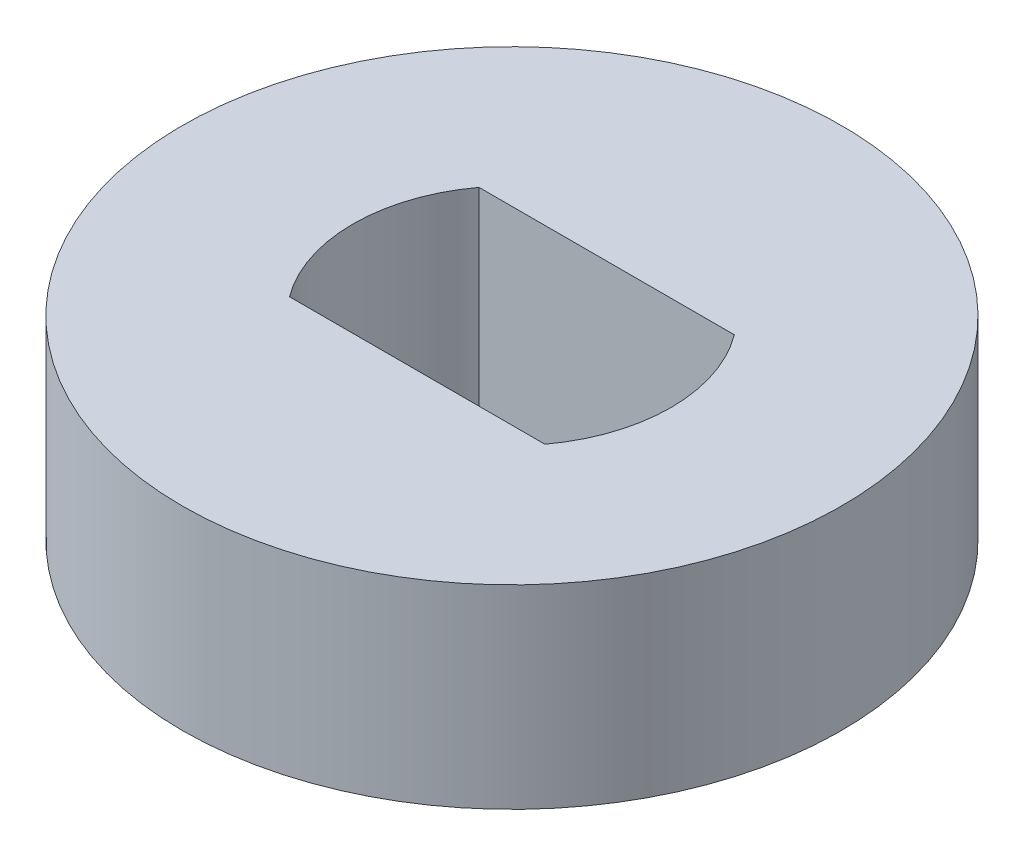
ISO-10303-21;
HEADER;
FILE_DESCRIPTION(('STEP AP214'),'2;1');
FILE_NAME('part.step','',(''),(''),'','','');
FILE_SCHEMA(('AUTOMOTIVE_DESIGN { 1 0 10303 214 1 1 1 1 }'));
ENDSEC;
DATA;
#1=APPLICATION_CONTEXT('core data for automotive mechanical design processes');
#2=APPLICATION_PROTOCOL_DEFINITION('international standard','automotive_design',2000,#1);
#3=PRODUCT_CONTEXT('',#1,'mechanical');
#4=PRODUCT('Part','Part','',(#3));
#5=PRODUCT_RELATED_PRODUCT_CATEGORY('part','',(#4));
#6=PRODUCT_DEFINITION_FORMATION('','',#4);
#7=PRODUCT_DEFINITION_CONTEXT('part definition',#1,'design');
#8=PRODUCT_DEFINITION('design','',#6,#7);
#9=PRODUCT_DEFINITION_SHAPE('','',#8);
#10=(LENGTH_UNIT() NAMED_UNIT(*) SI_UNIT(.MILLI.,.METRE.));
#11=(NAMED_UNIT(*) PLANE_ANGLE_UNIT() SI_UNIT($,.RADIAN.));
#12=(NAMED_UNIT(*) SI_UNIT($,.STERADIAN.) SOLID_ANGLE_UNIT());
#13=UNCERTAINTY_MEASURE_WITH_UNIT(LENGTH_MEASURE(1.E-05),#10,'distance_accuracy_value','');
#14=(GEOMETRIC_REPRESENTATION_CONTEXT(3) GLOBAL_UNCERTAINTY_ASSIGNED_CONTEXT((#13)) GLOBAL_UNIT_ASSIGNED_CONTEXT((#10,
#11,#12)) REPRESENTATION_CONTEXT('',''));
#15=CARTESIAN_POINT('',(0.,0.,0.));
#16=DIRECTION('',(0.,0.,1.));
#17=DIRECTION('',(1.,0.,0.));
#18=AXIS2_PLACEMENT_3D('',#15,#16,#17);
#19=CARTESIAN_POINT('',(0.,2.9972,0.));
#20=DIRECTION('',(0.,1.,0.));
#21=DIRECTION('',(0.,0.,1.));
#22=AXIS2_PLACEMENT_3D('',#19,#20,#21);
#23=PLANE('',#22);
#24=CARTESIAN_POINT('',(0.,2.9972,0.));
#25=DIRECTION('',(0.,1.,0.));
#26=DIRECTION('',(0.,0.,1.));
#27=AXIS2_PLACEMENT_3D('',#24,#25,#26);
#28=CIRCLE('',#27,5.08);
#29=CARTESIAN_POINT('',(0.,2.9972,5.08));
#30=VERTEX_POINT('',#29);
#31=EDGE_CURVE('E11',#30,#30,#28,.T.);
#32=ORIENTED_EDGE('',*,*,#31,.T.);
#33=EDGE_LOOP('',(#32));
#34=FACE_BOUND('',#33,.T.);
#35=DIRECTION('',(1.,0.,0.));
#36=VECTOR('',#35,1.);
#37=CARTESIAN_POINT('',(1.9685,2.9972,1.4605));
#38=LINE('',#37,#36);
#39=CARTESIAN_POINT('',(-1.9685,2.9972,1.4605));
#40=VERTEX_POINT('',#39);
#41=CARTESIAN_POINT('',(1.9685,2.9972,1.4605));
#42=VERTEX_POINT('',#41);
#43=EDGE_CURVE('E90',#40,#42,#38,.T.);
#44=ORIENTED_EDGE('',*,*,#43,.F.);
#45=CARTESIAN_POINT('',(0.,2.9972,0.));
#46=DIRECTION('',(0.,1.,0.));
#47=DIRECTION('',(0.,0.,1.));
#48=AXIS2_PLACEMENT_3D('',#45,#46,#47);
#49=CIRCLE('',#48,2.45113290133359);
#50=CARTESIAN_POINT('',(-1.9685,2.9972,-1.4605));
#51=VERTEX_POINT('',#50);
#52=EDGE_CURVE('E82',#51,#40,#49,.T.);
#53=ORIENTED_EDGE('',*,*,#52,.F.);
#54=DIRECTION('',(-1.,0.,0.));
#55=VECTOR('',#54,1.);
#56=CARTESIAN_POINT('',(-1.9685,2.9972,-1.4605));
#57=LINE('',#56,#55);
#58=CARTESIAN_POINT('',(1.9685,2.9972,-1.4605));
#59=VERTEX_POINT('',#58);
#60=EDGE_CURVE('E103',#59,#51,#57,.T.);
#61=ORIENTED_EDGE('',*,*,#60,.F.);
#62=CARTESIAN_POINT('',(0.,2.9972,0.));
#63=DIRECTION('',(0.,1.,0.));
#64=DIRECTION('',(0.,0.,1.));
#65=AXIS2_PLACEMENT_3D('',#62,#63,#64);
#66=CIRCLE('',#65,2.45113290133359);
#67=EDGE_CURVE('E101',#42,#59,#66,.T.);
#68=ORIENTED_EDGE('',*,*,#67,.F.);
#69=EDGE_LOOP('',(#44,#53,#61,#68));
#70=FACE_BOUND('',#69,.T.);
#71=ADVANCED_FACE('F41',(#34,#70),#23,.T.);
#72=CARTESIAN_POINT('',(0.,0.,0.));
#73=DIRECTION('',(0.,1.,0.));
#74=DIRECTION('',(0.,0.,1.));
#75=AXIS2_PLACEMENT_3D('',#72,#73,#74);
#76=PLANE('',#75);
#77=CARTESIAN_POINT('',(0.,0.,0.));
#78=DIRECTION('',(0.,1.,0.));
#79=DIRECTION('',(0.,0.,1.));
#80=AXIS2_PLACEMENT_3D('',#77,#78,#79);
#81=CIRCLE('',#80,5.08);
#82=CARTESIAN_POINT('',(0.,0.,5.08));
#83=VERTEX_POINT('',#82);
#84=EDGE_CURVE('E45',#83,#83,#81,.T.);
#85=ORIENTED_EDGE('',*,*,#84,.F.);
#86=EDGE_LOOP('',(#85));
#87=FACE_BOUND('',#86,.T.);
#88=CARTESIAN_POINT('',(0.,0.,0.));
#89=DIRECTION('',(0.,1.,0.));
#90=DIRECTION('',(0.,0.,1.));
#91=AXIS2_PLACEMENT_3D('',#88,#89,#90);
#92=CIRCLE('',#91,2.45113290133359);
#93=CARTESIAN_POINT('',(-1.9685,0.,-1.4605));
#94=VERTEX_POINT('',#93);
#95=CARTESIAN_POINT('',(-1.9685,0.,1.4605));
#96=VERTEX_POINT('',#95);
#97=EDGE_CURVE('E64',#94,#96,#92,.T.);
#98=ORIENTED_EDGE('',*,*,#97,.T.);
#99=DIRECTION('',(1.,0.,0.));
#100=VECTOR('',#99,1.);
#101=CARTESIAN_POINT('',(1.9685,0.,1.4605));
#102=LINE('',#101,#100);
#103=CARTESIAN_POINT('',(1.9685,0.,1.4605));
#104=VERTEX_POINT('',#103);
#105=EDGE_CURVE('E97',#96,#104,#102,.T.);
#106=ORIENTED_EDGE('',*,*,#105,.T.);
#107=CARTESIAN_POINT('',(0.,0.,0.));
#108=DIRECTION('',(0.,1.,0.));
#109=DIRECTION('',(0.,0.,1.));
#110=AXIS2_PLACEMENT_3D('',#107,#108,#109);
#111=CIRCLE('',#110,2.45113290133359);
#112=CARTESIAN_POINT('',(1.9685,0.,-1.4605));
#113=VERTEX_POINT('',#112);
#114=EDGE_CURVE('E109',#104,#113,#111,.T.);
#115=ORIENTED_EDGE('',*,*,#114,.T.);
#116=DIRECTION('',(-1.,0.,0.));
#117=VECTOR('',#116,1.);
#118=CARTESIAN_POINT('',(-1.9685,0.,-1.4605));
#119=LINE('',#118,#117);
#120=EDGE_CURVE('E91',#113,#94,#119,.T.);
#121=ORIENTED_EDGE('',*,*,#120,.T.);
#122=EDGE_LOOP('',(#98,#106,#115,#121));
#123=FACE_BOUND('',#122,.T.);
#124=ADVANCED_FACE('F120',(#87,#123),#76,.F.);
#125=CARTESIAN_POINT('',(0.,2.9972,0.));
#126=DIRECTION('',(0.,-1.,0.));
#127=DIRECTION('',(0.,0.,-1.));
#128=AXIS2_PLACEMENT_3D('',#125,#126,#127);
#129=CYLINDRICAL_SURFACE('',#128,5.08);
#130=ORIENTED_EDGE('',*,*,#31,.F.);
#131=EDGE_LOOP('',(#130));
#132=FACE_BOUND('',#131,.T.);
#133=ORIENTED_EDGE('',*,*,#84,.T.);
#134=EDGE_LOOP('',(#133));
#135=FACE_BOUND('',#134,.T.);
#136=ADVANCED_FACE('F43',(#132,#135),#129,.T.);
#137=CARTESIAN_POINT('',(0.,2.9972,0.));
#138=DIRECTION('',(0.,-1.,0.));
#139=DIRECTION('',(0.,0.,-1.));
#140=AXIS2_PLACEMENT_3D('',#137,#138,#139);
#141=CYLINDRICAL_SURFACE('',#140,2.45113290133359);
#142=ORIENTED_EDGE('',*,*,#97,.F.);
#143=DIRECTION('',(0.,-1.,0.));
#144=VECTOR('',#143,1.);
#145=CARTESIAN_POINT('',(-1.9685,2.9972,-1.4605));
#146=LINE('',#145,#144);
#147=EDGE_CURVE('E86',#51,#94,#146,.T.);
#148=ORIENTED_EDGE('',*,*,#147,.F.);
#149=ORIENTED_EDGE('',*,*,#52,.T.);
#150=DIRECTION('',(0.,-1.,0.));
#151=VECTOR('',#150,1.);
#152=CARTESIAN_POINT('',(-1.9685,2.9972,1.4605));
#153=LINE('',#152,#151);
#154=EDGE_CURVE('E85',#40,#96,#153,.T.);
#155=ORIENTED_EDGE('',*,*,#154,.T.);
#156=EDGE_LOOP('',(#142,#148,#149,#155));
#157=FACE_BOUND('',#156,.T.);
#158=ADVANCED_FACE('F84',(#157),#141,.F.);
#159=CARTESIAN_POINT('',(1.9685,2.9972,1.4605));
#160=DIRECTION('',(0.,0.,-1.));
#161=DIRECTION('',(-1.,0.,0.));
#162=AXIS2_PLACEMENT_3D('',#159,#160,#161);
#163=PLANE('',#162);
#164=ORIENTED_EDGE('',*,*,#105,.F.);
#165=ORIENTED_EDGE('',*,*,#154,.F.);
#166=ORIENTED_EDGE('',*,*,#43,.T.);
#167=DIRECTION('',(0.,-1.,0.));
#168=VECTOR('',#167,1.);
#169=CARTESIAN_POINT('',(1.9685,2.9972,1.4605));
#170=LINE('',#169,#168);
#171=EDGE_CURVE('E98',#42,#104,#170,.T.);
#172=ORIENTED_EDGE('',*,*,#171,.T.);
#173=EDGE_LOOP('',(#164,#165,#166,#172));
#174=FACE_BOUND('',#173,.T.);
#175=ADVANCED_FACE('F94',(#174),#163,.T.);
#176=CARTESIAN_POINT('',(0.,2.9972,0.));
#177=DIRECTION('',(0.,-1.,0.));
#178=DIRECTION('',(0.,0.,-1.));
#179=AXIS2_PLACEMENT_3D('',#176,#177,#178);
#180=CYLINDRICAL_SURFACE('',#179,2.45113290133359);
#181=ORIENTED_EDGE('',*,*,#114,.F.);
#182=ORIENTED_EDGE('',*,*,#171,.F.);
#183=ORIENTED_EDGE('',*,*,#67,.T.);
#184=DIRECTION('',(0.,-1.,0.));
#185=VECTOR('',#184,1.);
#186=CARTESIAN_POINT('',(1.9685,2.9972,-1.4605));
#187=LINE('',#186,#185);
#188=EDGE_CURVE('E56',#59,#113,#187,.T.);
#189=ORIENTED_EDGE('',*,*,#188,.T.);
#190=EDGE_LOOP('',(#181,#182,#183,#189));
#191=FACE_BOUND('',#190,.T.);
#192=ADVANCED_FACE('F118',(#191),#180,.F.);
#193=CARTESIAN_POINT('',(-1.9685,2.9972,-1.4605));
#194=DIRECTION('',(0.,0.,1.));
#195=DIRECTION('',(1.,0.,0.));
#196=AXIS2_PLACEMENT_3D('',#193,#194,#195);
#197=PLANE('',#196);
#198=ORIENTED_EDGE('',*,*,#120,.F.);
#199=ORIENTED_EDGE('',*,*,#188,.F.);
#200=ORIENTED_EDGE('',*,*,#60,.T.);
#201=ORIENTED_EDGE('',*,*,#147,.T.);
#202=EDGE_LOOP('',(#198,#199,#200,#201));
#203=FACE_BOUND('',#202,.T.);
#204=ADVANCED_FACE('F121',(#203),#197,.T.);
#205=CLOSED_SHELL('',(#71,#124,#136,#158,#175,#192,#204));
#206=MANIFOLD_SOLID_BREP('B2',#205);
#207=ADVANCED_BREP_SHAPE_REPRESENTATION('',(#18,#206),#14);
#208=SHAPE_DEFINITION_REPRESENTATION(#9,#207);
ENDSEC;
END-ISO-10303-21;
